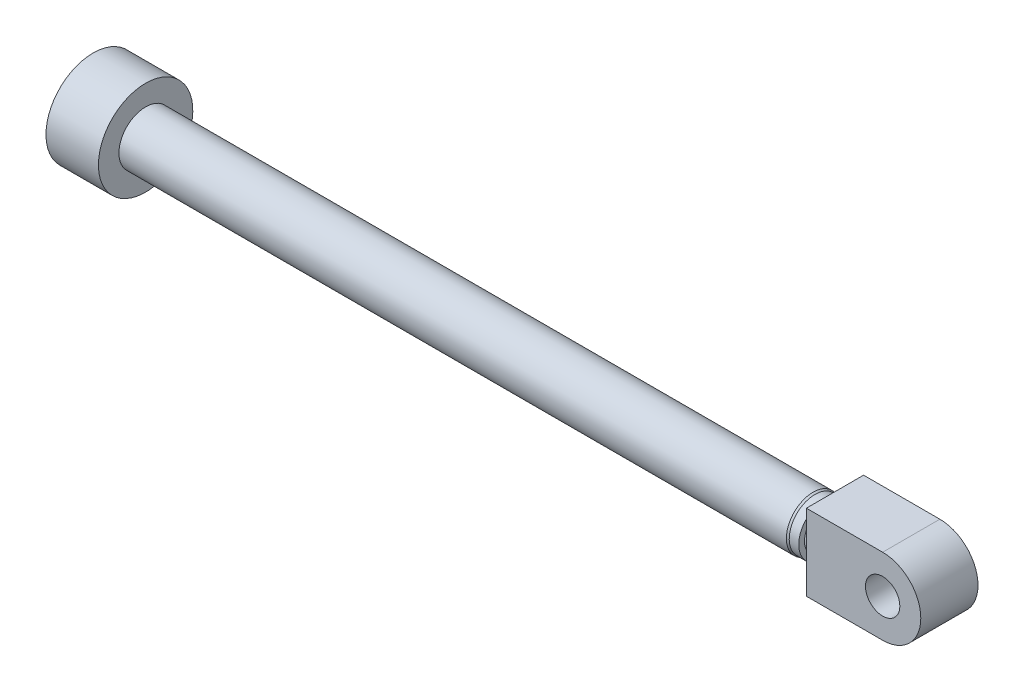
ISO-10303-21;
HEADER;
FILE_DESCRIPTION(('STEP AP214'),'2;1');
FILE_NAME('part.step','',(''),(''),'','','');
FILE_SCHEMA(('AUTOMOTIVE_DESIGN { 1 0 10303 214 1 1 1 1 }'));
ENDSEC;
DATA;
#1=APPLICATION_CONTEXT('core data for automotive mechanical design processes');
#2=APPLICATION_PROTOCOL_DEFINITION('international standard','automotive_design',2000,#1);
#3=PRODUCT_CONTEXT('',#1,'mechanical');
#4=PRODUCT('Part','Part','',(#3));
#5=PRODUCT_RELATED_PRODUCT_CATEGORY('part','',(#4));
#6=PRODUCT_DEFINITION_FORMATION('','',#4);
#7=PRODUCT_DEFINITION_CONTEXT('part definition',#1,'design');
#8=PRODUCT_DEFINITION('design','',#6,#7);
#9=PRODUCT_DEFINITION_SHAPE('','',#8);
#10=(LENGTH_UNIT() NAMED_UNIT(*) SI_UNIT(.MILLI.,.METRE.));
#11=(NAMED_UNIT(*) PLANE_ANGLE_UNIT() SI_UNIT($,.RADIAN.));
#12=(NAMED_UNIT(*) SI_UNIT($,.STERADIAN.) SOLID_ANGLE_UNIT());
#13=UNCERTAINTY_MEASURE_WITH_UNIT(LENGTH_MEASURE(1.E-05),#10,'distance_accuracy_value','');
#14=(GEOMETRIC_REPRESENTATION_CONTEXT(3) GLOBAL_UNCERTAINTY_ASSIGNED_CONTEXT((#13)) GLOBAL_UNIT_ASSIGNED_CONTEXT((#10,
#11,#12)) REPRESENTATION_CONTEXT('',''));
#15=CARTESIAN_POINT('',(0.,0.,0.));
#16=DIRECTION('',(0.,0.,1.));
#17=DIRECTION('',(1.,0.,0.));
#18=AXIS2_PLACEMENT_3D('',#15,#16,#17);
#19=CARTESIAN_POINT('',(823.,0.,0.));
#20=DIRECTION('',(1.,0.,0.));
#21=DIRECTION('',(0.,1.,0.));
#22=AXIS2_PLACEMENT_3D('',#19,#20,#21);
#23=CYLINDRICAL_SURFACE('',#22,20.9999999999999);
#24=CARTESIAN_POINT('',(767.,0.,0.));
#25=DIRECTION('',(1.,0.,0.));
#26=DIRECTION('',(0.,1.,0.));
#27=AXIS2_PLACEMENT_3D('',#24,#25,#26);
#28=CIRCLE('',#27,20.9999999999999);
#29=CARTESIAN_POINT('',(767.,21.,0.));
#30=VERTEX_POINT('',#29);
#31=EDGE_CURVE('E76',#30,#30,#28,.T.);
#32=ORIENTED_EDGE('',*,*,#31,.T.);
#33=EDGE_LOOP('',(#32));
#34=FACE_BOUND('',#33,.T.);
#35=CARTESIAN_POINT('',(823.,0.,0.));
#36=DIRECTION('',(1.,0.,0.));
#37=DIRECTION('',(0.,1.,0.));
#38=AXIS2_PLACEMENT_3D('',#35,#36,#37);
#39=CIRCLE('',#38,20.9999999999999);
#40=CARTESIAN_POINT('',(823.,21.,0.));
#41=VERTEX_POINT('',#40);
#42=EDGE_CURVE('E98',#41,#41,#39,.T.);
#43=ORIENTED_EDGE('',*,*,#42,.F.);
#44=EDGE_LOOP('',(#43));
#45=FACE_BOUND('',#44,.T.);
#46=ADVANCED_FACE('F73',(#34,#45),#23,.T.);
#47=CARTESIAN_POINT('',(0.,0.,0.));
#48=DIRECTION('',(-1.,0.,0.));
#49=DIRECTION('',(0.,-1.,0.));
#50=AXIS2_PLACEMENT_3D('',#47,#48,#49);
#51=PLANE('',#50);
#52=CARTESIAN_POINT('',(0.,0.,0.));
#53=DIRECTION('',(1.,0.,0.));
#54=DIRECTION('',(0.,1.,0.));
#55=AXIS2_PLACEMENT_3D('',#52,#53,#54);
#56=CIRCLE('',#55,49.5);
#57=CARTESIAN_POINT('',(0.,49.5,0.));
#58=VERTEX_POINT('',#57);
#59=EDGE_CURVE('E95',#58,#58,#56,.T.);
#60=ORIENTED_EDGE('',*,*,#59,.F.);
#61=EDGE_LOOP('',(#60));
#62=FACE_BOUND('',#61,.T.);
#63=ADVANCED_FACE('F120',(#62),#51,.T.);
#64=CARTESIAN_POINT('',(823.,0.,0.));
#65=DIRECTION('',(1.,0.,0.));
#66=DIRECTION('',(0.,1.,0.));
#67=AXIS2_PLACEMENT_3D('',#64,#65,#66);
#68=CYLINDRICAL_SURFACE('',#67,49.5);
#69=ORIENTED_EDGE('',*,*,#59,.T.);
#70=EDGE_LOOP('',(#69));
#71=FACE_BOUND('',#70,.T.);
#72=CARTESIAN_POINT('',(55.,0.,0.));
#73=DIRECTION('',(1.,0.,0.));
#74=DIRECTION('',(0.,1.,0.));
#75=AXIS2_PLACEMENT_3D('',#72,#73,#74);
#76=CIRCLE('',#75,49.5);
#77=CARTESIAN_POINT('',(55.,49.5,0.));
#78=VERTEX_POINT('',#77);
#79=EDGE_CURVE('E92',#78,#78,#76,.T.);
#80=ORIENTED_EDGE('',*,*,#79,.F.);
#81=EDGE_LOOP('',(#80));
#82=FACE_BOUND('',#81,.T.);
#83=ADVANCED_FACE('F124',(#71,#82),#68,.T.);
#84=CARTESIAN_POINT('',(55.,49.5,0.));
#85=DIRECTION('',(1.,0.,0.));
#86=DIRECTION('',(0.,1.,0.));
#87=AXIS2_PLACEMENT_3D('',#84,#85,#86);
#88=PLANE('',#87);
#89=ORIENTED_EDGE('',*,*,#79,.T.);
#90=EDGE_LOOP('',(#89));
#91=FACE_BOUND('',#90,.T.);
#92=CARTESIAN_POINT('',(55.,0.,0.));
#93=DIRECTION('',(1.,0.,0.));
#94=DIRECTION('',(0.,1.,0.));
#95=AXIS2_PLACEMENT_3D('',#92,#93,#94);
#96=CIRCLE('',#95,28.);
#97=CARTESIAN_POINT('',(55.,28.,0.));
#98=VERTEX_POINT('',#97);
#99=EDGE_CURVE('E89',#98,#98,#96,.T.);
#100=ORIENTED_EDGE('',*,*,#99,.F.);
#101=EDGE_LOOP('',(#100));
#102=FACE_BOUND('',#101,.T.);
#103=ADVANCED_FACE('F130',(#91,#102),#88,.T.);
#104=CARTESIAN_POINT('',(823.,0.,0.));
#105=DIRECTION('',(1.,0.,0.));
#106=DIRECTION('',(0.,1.,0.));
#107=AXIS2_PLACEMENT_3D('',#104,#105,#106);
#108=CYLINDRICAL_SURFACE('',#107,28.);
#109=ORIENTED_EDGE('',*,*,#99,.T.);
#110=EDGE_LOOP('',(#109));
#111=FACE_BOUND('',#110,.T.);
#112=CARTESIAN_POINT('',(755.,0.,0.));
#113=DIRECTION('',(1.,0.,0.));
#114=DIRECTION('',(0.,1.,0.));
#115=AXIS2_PLACEMENT_3D('',#112,#113,#114);
#116=CIRCLE('',#115,27.9999999999999);
#117=CARTESIAN_POINT('',(755.,28.,0.));
#118=VERTEX_POINT('',#117);
#119=EDGE_CURVE('E84',#118,#118,#116,.T.);
#120=ORIENTED_EDGE('',*,*,#119,.F.);
#121=EDGE_LOOP('',(#120));
#122=FACE_BOUND('',#121,.T.);
#123=ADVANCED_FACE('F137',(#111,#122),#108,.T.);
#124=CARTESIAN_POINT('',(757.,0.,0.));
#125=DIRECTION('',(-1.,0.,0.));
#126=DIRECTION('',(0.,-1.,0.));
#127=AXIS2_PLACEMENT_3D('',#124,#125,#126);
#128=CONICAL_SURFACE('',#127,26.9999999999999,0.463647609000803);
#129=ORIENTED_EDGE('',*,*,#119,.T.);
#130=EDGE_LOOP('',(#129));
#131=FACE_BOUND('',#130,.T.);
#132=CARTESIAN_POINT('',(757.,0.,0.));
#133=DIRECTION('',(1.,0.,0.));
#134=DIRECTION('',(0.,1.,0.));
#135=AXIS2_PLACEMENT_3D('',#132,#133,#134);
#136=CIRCLE('',#135,26.9999999999999);
#137=CARTESIAN_POINT('',(757.,27.,0.));
#138=VERTEX_POINT('',#137);
#139=EDGE_CURVE('E80',#138,#138,#136,.T.);
#140=ORIENTED_EDGE('',*,*,#139,.F.);
#141=EDGE_LOOP('',(#140));
#142=FACE_BOUND('',#141,.T.);
#143=ADVANCED_FACE('F116',(#131,#142),#128,.T.);
#144=CARTESIAN_POINT('',(823.,0.,0.));
#145=DIRECTION('',(1.,0.,0.));
#146=DIRECTION('',(0.,1.,0.));
#147=AXIS2_PLACEMENT_3D('',#144,#145,#146);
#148=CYLINDRICAL_SURFACE('',#147,26.9999999999999);
#149=ORIENTED_EDGE('',*,*,#139,.T.);
#150=EDGE_LOOP('',(#149));
#151=FACE_BOUND('',#150,.T.);
#152=CARTESIAN_POINT('',(767.,0.,0.));
#153=DIRECTION('',(1.,0.,0.));
#154=DIRECTION('',(0.,1.,0.));
#155=AXIS2_PLACEMENT_3D('',#152,#153,#154);
#156=CIRCLE('',#155,26.9999999999999);
#157=CARTESIAN_POINT('',(767.,27.,0.));
#158=VERTEX_POINT('',#157);
#159=EDGE_CURVE('E12',#158,#158,#156,.T.);
#160=ORIENTED_EDGE('',*,*,#159,.F.);
#161=EDGE_LOOP('',(#160));
#162=FACE_BOUND('',#161,.T.);
#163=ADVANCED_FACE('F110',(#151,#162),#148,.T.);
#164=CARTESIAN_POINT('',(767.,27.,0.));
#165=DIRECTION('',(1.,0.,0.));
#166=DIRECTION('',(0.,1.,0.));
#167=AXIS2_PLACEMENT_3D('',#164,#165,#166);
#168=PLANE('',#167);
#169=ORIENTED_EDGE('',*,*,#159,.T.);
#170=EDGE_LOOP('',(#169));
#171=FACE_BOUND('',#170,.T.);
#172=ORIENTED_EDGE('',*,*,#31,.F.);
#173=EDGE_LOOP('',(#172));
#174=FACE_BOUND('',#173,.T.);
#175=ADVANCED_FACE('F107',(#171,#174),#168,.T.);
#176=CARTESIAN_POINT('',(823.,21.,0.));
#177=DIRECTION('',(1.,0.,0.));
#178=DIRECTION('',(0.,1.,0.));
#179=AXIS2_PLACEMENT_3D('',#176,#177,#178);
#180=PLANE('',#179);
#181=ORIENTED_EDGE('',*,*,#42,.T.);
#182=EDGE_LOOP('',(#181));
#183=FACE_BOUND('',#182,.T.);
#184=ADVANCED_FACE('F109',(#183),#180,.T.);
#185=CLOSED_SHELL('',(#46,#63,#83,#103,#123,#143,#163,#175,#184));
#186=MANIFOLD_SOLID_BREP('B2',#185);
#187=CARTESIAN_POINT('',(778.,0.,0.));
#188=DIRECTION('',(1.,0.,0.));
#189=DIRECTION('',(0.,1.,0.));
#190=AXIS2_PLACEMENT_3D('',#187,#188,#189);
#191=PLANE('',#190);
#192=CARTESIAN_POINT('',(778.,0.,0.));
#193=DIRECTION('',(1.,0.,0.));
#194=DIRECTION('',(0.,1.,0.));
#195=AXIS2_PLACEMENT_3D('',#192,#193,#194);
#196=CIRCLE('',#195,21.25);
#197=CARTESIAN_POINT('',(778.,21.2500000000001,0.));
#198=VERTEX_POINT('',#197);
#199=EDGE_CURVE('E278',#198,#198,#196,.T.);
#200=ORIENTED_EDGE('',*,*,#199,.T.);
#201=EDGE_LOOP('',(#200));
#202=FACE_BOUND('',#201,.T.);
#203=DIRECTION('',(0.,0.,1.));
#204=VECTOR('',#203,1.);
#205=CARTESIAN_POINT('',(778.,40.,0.));
#206=LINE('',#205,#204);
#207=CARTESIAN_POINT('',(778.,40.,-30.));
#208=VERTEX_POINT('',#207);
#209=CARTESIAN_POINT('',(778.,40.,30.));
#210=VERTEX_POINT('',#209);
#211=EDGE_CURVE('E71',#208,#210,#206,.T.);
#212=ORIENTED_EDGE('',*,*,#211,.F.);
#213=DIRECTION('',(0.,-1.,0.));
#214=VECTOR('',#213,1.);
#215=CARTESIAN_POINT('',(778.,0.,-30.));
#216=LINE('',#215,#214);
#217=CARTESIAN_POINT('',(778.,-39.9999999999998,-30.));
#218=VERTEX_POINT('',#217);
#219=EDGE_CURVE('E273',#208,#218,#216,.T.);
#220=ORIENTED_EDGE('',*,*,#219,.T.);
#221=DIRECTION('',(0.,0.,1.));
#222=VECTOR('',#221,1.);
#223=CARTESIAN_POINT('',(778.,-39.9999999999998,0.));
#224=LINE('',#223,#222);
#225=CARTESIAN_POINT('',(778.,-39.9999999999998,30.));
#226=VERTEX_POINT('',#225);
#227=EDGE_CURVE('E216',#218,#226,#224,.T.);
#228=ORIENTED_EDGE('',*,*,#227,.T.);
#229=DIRECTION('',(0.,-1.,0.));
#230=VECTOR('',#229,1.);
#231=CARTESIAN_POINT('',(778.,0.,30.));
#232=LINE('',#231,#230);
#233=EDGE_CURVE('E224',#210,#226,#232,.T.);
#234=ORIENTED_EDGE('',*,*,#233,.F.);
#235=EDGE_LOOP('',(#212,#220,#228,#234));
#236=FACE_BOUND('',#235,.T.);
#237=ADVANCED_FACE('F207',(#202,#236),#191,.F.);
#238=CARTESIAN_POINT('',(858.,0.,-77.9540784294923));
#239=DIRECTION('',(0.,0.,1.));
#240=DIRECTION('',(1.,0.,0.));
#241=AXIS2_PLACEMENT_3D('',#238,#239,#240);
#242=CYLINDRICAL_SURFACE('',#241,40.);
#243=CARTESIAN_POINT('',(858.,0.,-30.));
#244=DIRECTION('',(0.,0.,1.));
#245=DIRECTION('',(1.,0.,0.));
#246=AXIS2_PLACEMENT_3D('',#243,#244,#245);
#247=CIRCLE('',#246,40.);
#248=CARTESIAN_POINT('',(858.,40.,-30.));
#249=VERTEX_POINT('',#248);
#250=CARTESIAN_POINT('',(858.,-39.9999999999998,-30.));
#251=VERTEX_POINT('',#250);
#252=EDGE_CURVE('E232',#249,#251,#247,.F.);
#253=ORIENTED_EDGE('',*,*,#252,.F.);
#254=DIRECTION('',(0.,0.,1.));
#255=VECTOR('',#254,1.);
#256=CARTESIAN_POINT('',(858.,40.,-77.9540784294923));
#257=LINE('',#256,#255);
#258=CARTESIAN_POINT('',(858.,40.,30.));
#259=VERTEX_POINT('',#258);
#260=EDGE_CURVE('E265',#249,#259,#257,.T.);
#261=ORIENTED_EDGE('',*,*,#260,.T.);
#262=CARTESIAN_POINT('',(858.,0.,30.));
#263=DIRECTION('',(0.,0.,1.));
#264=DIRECTION('',(1.,0.,0.));
#265=AXIS2_PLACEMENT_3D('',#262,#263,#264);
#266=CIRCLE('',#265,40.);
#267=CARTESIAN_POINT('',(858.,-39.9999999999998,30.));
#268=VERTEX_POINT('',#267);
#269=EDGE_CURVE('E251',#259,#268,#266,.F.);
#270=ORIENTED_EDGE('',*,*,#269,.T.);
#271=DIRECTION('',(0.,0.,1.));
#272=VECTOR('',#271,1.);
#273=CARTESIAN_POINT('',(858.,-39.9999999999998,-77.9540784294923));
#274=LINE('',#273,#272);
#275=EDGE_CURVE('E263',#251,#268,#274,.T.);
#276=ORIENTED_EDGE('',*,*,#275,.F.);
#277=EDGE_LOOP('',(#253,#261,#270,#276));
#278=FACE_BOUND('',#277,.T.);
#279=ADVANCED_FACE('F262',(#278),#242,.T.);
#280=CARTESIAN_POINT('',(0.,40.,-77.9540784294923));
#281=DIRECTION('',(0.,1.,0.));
#282=DIRECTION('',(0.,0.,1.));
#283=AXIS2_PLACEMENT_3D('',#280,#281,#282);
#284=PLANE('',#283);
#285=DIRECTION('',(1.,0.,0.));
#286=VECTOR('',#285,1.);
#287=CARTESIAN_POINT('',(0.,40.,-30.));
#288=LINE('',#287,#286);
#289=EDGE_CURVE('E269',#208,#249,#288,.T.);
#290=ORIENTED_EDGE('',*,*,#289,.F.);
#291=ORIENTED_EDGE('',*,*,#211,.T.);
#292=DIRECTION('',(1.,0.,0.));
#293=VECTOR('',#292,1.);
#294=CARTESIAN_POINT('',(0.,40.,30.));
#295=LINE('',#294,#293);
#296=EDGE_CURVE('E329',#210,#259,#295,.T.);
#297=ORIENTED_EDGE('',*,*,#296,.T.);
#298=ORIENTED_EDGE('',*,*,#260,.F.);
#299=EDGE_LOOP('',(#290,#291,#297,#298));
#300=FACE_BOUND('',#299,.T.);
#301=ADVANCED_FACE('F301',(#300),#284,.T.);
#302=CARTESIAN_POINT('',(0.,-40.,-77.9540784294923));
#303=DIRECTION('',(0.,1.,0.));
#304=DIRECTION('',(-1.,0.,0.));
#305=AXIS2_PLACEMENT_3D('',#302,#303,#304);
#306=PLANE('',#305);
#307=ORIENTED_EDGE('',*,*,#227,.F.);
#308=DIRECTION('',(1.,0.,0.));
#309=VECTOR('',#308,1.);
#310=CARTESIAN_POINT('',(0.,-40.,-30.));
#311=LINE('',#310,#309);
#312=EDGE_CURVE('E268',#218,#251,#311,.T.);
#313=ORIENTED_EDGE('',*,*,#312,.T.);
#314=ORIENTED_EDGE('',*,*,#275,.T.);
#315=DIRECTION('',(1.,0.,0.));
#316=VECTOR('',#315,1.);
#317=CARTESIAN_POINT('',(0.,-40.,30.));
#318=LINE('',#317,#316);
#319=EDGE_CURVE('E247',#226,#268,#318,.T.);
#320=ORIENTED_EDGE('',*,*,#319,.F.);
#321=EDGE_LOOP('',(#307,#313,#314,#320));
#322=FACE_BOUND('',#321,.T.);
#323=ADVANCED_FACE('F267',(#322),#306,.F.);
#324=CARTESIAN_POINT('',(898.,1.09470925761811E-13,0.));
#325=DIRECTION('',(-1.,0.,0.));
#326=DIRECTION('',(0.,-1.,0.));
#327=AXIS2_PLACEMENT_3D('',#324,#325,#326);
#328=CYLINDRICAL_SURFACE('',#327,21.25);
#329=ORIENTED_EDGE('',*,*,#199,.F.);
#330=EDGE_LOOP('',(#329));
#331=FACE_BOUND('',#330,.T.);
#332=CARTESIAN_POINT('',(824.,1.00449936333778E-13,0.));
#333=DIRECTION('',(1.,0.,0.));
#334=DIRECTION('',(0.,1.,0.));
#335=AXIS2_PLACEMENT_3D('',#332,#333,#334);
#336=CIRCLE('',#335,21.25);
#337=CARTESIAN_POINT('',(824.,21.2500000000001,0.));
#338=VERTEX_POINT('',#337);
#339=EDGE_CURVE('E271',#338,#338,#336,.T.);
#340=ORIENTED_EDGE('',*,*,#339,.T.);
#341=EDGE_LOOP('',(#340));
#342=FACE_BOUND('',#341,.T.);
#343=ADVANCED_FACE('F209',(#331,#342),#328,.F.);
#344=CARTESIAN_POINT('',(824.,1.00449936333778E-13,0.));
#345=DIRECTION('',(1.,0.,0.));
#346=DIRECTION('',(0.,1.,0.));
#347=AXIS2_PLACEMENT_3D('',#344,#345,#346);
#348=PLANE('',#347);
#349=ORIENTED_EDGE('',*,*,#339,.F.);
#350=EDGE_LOOP('',(#349));
#351=FACE_BOUND('',#350,.T.);
#352=ADVANCED_FACE('F303',(#351),#348,.F.);
#353=CARTESIAN_POINT('',(0.,-49.5,30.));
#354=DIRECTION('',(0.,0.,1.));
#355=DIRECTION('',(1.,0.,0.));
#356=AXIS2_PLACEMENT_3D('',#353,#354,#355);
#357=PLANE('',#356);
#358=ORIENTED_EDGE('',*,*,#233,.T.);
#359=ORIENTED_EDGE('',*,*,#319,.T.);
#360=ORIENTED_EDGE('',*,*,#269,.F.);
#361=ORIENTED_EDGE('',*,*,#296,.F.);
#362=EDGE_LOOP('',(#358,#359,#360,#361));
#363=FACE_BOUND('',#362,.T.);
#364=CARTESIAN_POINT('',(858.,0.,30.));
#365=DIRECTION('',(0.,0.,1.));
#366=DIRECTION('',(1.,0.,0.));
#367=AXIS2_PLACEMENT_3D('',#364,#365,#366);
#368=CIRCLE('',#367,18.);
#369=CARTESIAN_POINT('',(876.,0.,30.));
#370=VERTEX_POINT('',#369);
#371=EDGE_CURVE('E257',#370,#370,#368,.F.);
#372=ORIENTED_EDGE('',*,*,#371,.T.);
#373=EDGE_LOOP('',(#372));
#374=FACE_BOUND('',#373,.T.);
#375=ADVANCED_FACE('F249',(#363,#374),#357,.T.);
#376=CARTESIAN_POINT('',(0.,-49.5,-30.));
#377=DIRECTION('',(0.,0.,1.));
#378=DIRECTION('',(1.,0.,0.));
#379=AXIS2_PLACEMENT_3D('',#376,#377,#378);
#380=PLANE('',#379);
#381=ORIENTED_EDGE('',*,*,#289,.T.);
#382=ORIENTED_EDGE('',*,*,#252,.T.);
#383=ORIENTED_EDGE('',*,*,#312,.F.);
#384=ORIENTED_EDGE('',*,*,#219,.F.);
#385=EDGE_LOOP('',(#381,#382,#383,#384));
#386=FACE_BOUND('',#385,.T.);
#387=CARTESIAN_POINT('',(858.,0.,-30.));
#388=DIRECTION('',(0.,0.,1.));
#389=DIRECTION('',(1.,0.,0.));
#390=AXIS2_PLACEMENT_3D('',#387,#388,#389);
#391=CIRCLE('',#390,18.);
#392=CARTESIAN_POINT('',(876.,0.,-30.));
#393=VERTEX_POINT('',#392);
#394=EDGE_CURVE('E211',#393,#393,#391,.F.);
#395=ORIENTED_EDGE('',*,*,#394,.F.);
#396=EDGE_LOOP('',(#395));
#397=FACE_BOUND('',#396,.T.);
#398=ADVANCED_FACE('F286',(#386,#397),#380,.F.);
#399=CARTESIAN_POINT('',(858.,0.,-77.9540784294923));
#400=DIRECTION('',(0.,0.,1.));
#401=DIRECTION('',(1.,0.,0.));
#402=AXIS2_PLACEMENT_3D('',#399,#400,#401);
#403=CYLINDRICAL_SURFACE('',#402,18.);
#404=ORIENTED_EDGE('',*,*,#394,.T.);
#405=EDGE_LOOP('',(#404));
#406=FACE_BOUND('',#405,.T.);
#407=ORIENTED_EDGE('',*,*,#371,.F.);
#408=EDGE_LOOP('',(#407));
#409=FACE_BOUND('',#408,.T.);
#410=ADVANCED_FACE('F284',(#406,#409),#403,.F.);
#411=CLOSED_SHELL('',(#237,#279,#301,#323,#343,#352,#375,#398,#410));
#412=MANIFOLD_SOLID_BREP('B7',#411);
#413=ADVANCED_BREP_SHAPE_REPRESENTATION('',(#18,#186,#412),#14);
#414=SHAPE_DEFINITION_REPRESENTATION(#9,#413);
ENDSEC;
END-ISO-10303-21;
